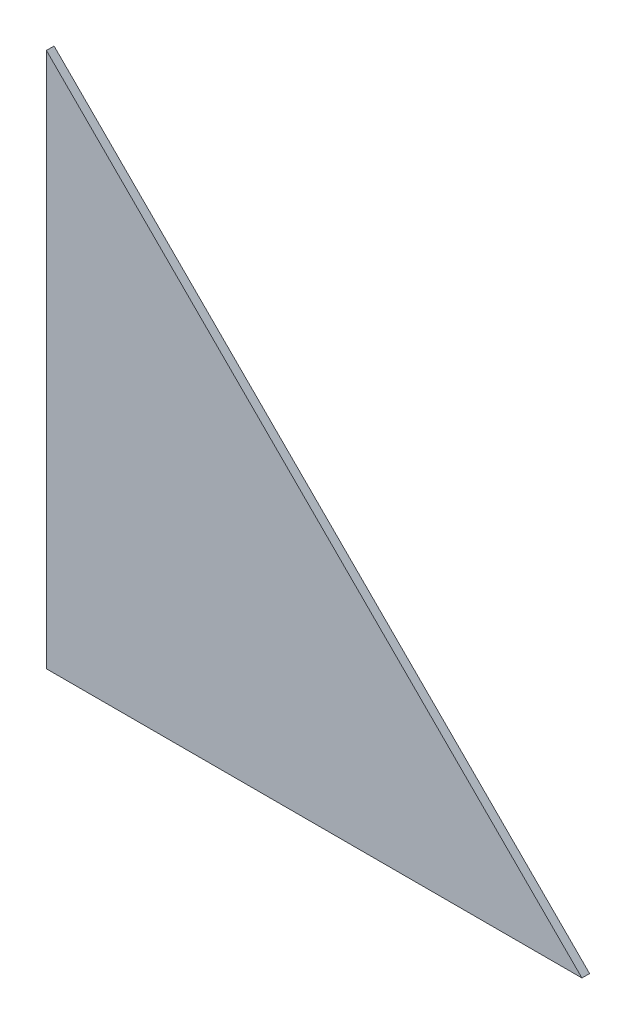
ISO-10303-21;
HEADER;
FILE_DESCRIPTION(('STEP AP214'),'2;1');
FILE_NAME('part.step','',(''),(''),'','','');
FILE_SCHEMA(('AUTOMOTIVE_DESIGN { 1 0 10303 214 1 1 1 1 }'));
ENDSEC;
DATA;
#1=APPLICATION_CONTEXT('core data for automotive mechanical design processes');
#2=APPLICATION_PROTOCOL_DEFINITION('international standard','automotive_design',2000,#1);
#3=PRODUCT_CONTEXT('',#1,'mechanical');
#4=PRODUCT('Part','Part','',(#3));
#5=PRODUCT_RELATED_PRODUCT_CATEGORY('part','',(#4));
#6=PRODUCT_DEFINITION_FORMATION('','',#4);
#7=PRODUCT_DEFINITION_CONTEXT('part definition',#1,'design');
#8=PRODUCT_DEFINITION('design','',#6,#7);
#9=PRODUCT_DEFINITION_SHAPE('','',#8);
#10=(LENGTH_UNIT() NAMED_UNIT(*) SI_UNIT(.MILLI.,.METRE.));
#11=(NAMED_UNIT(*) PLANE_ANGLE_UNIT() SI_UNIT($,.RADIAN.));
#12=(NAMED_UNIT(*) SI_UNIT($,.STERADIAN.) SOLID_ANGLE_UNIT());
#13=UNCERTAINTY_MEASURE_WITH_UNIT(LENGTH_MEASURE(1.E-05),#10,'distance_accuracy_value','');
#14=(GEOMETRIC_REPRESENTATION_CONTEXT(3) GLOBAL_UNCERTAINTY_ASSIGNED_CONTEXT((#13)) GLOBAL_UNIT_ASSIGNED_CONTEXT((#10,
#11,#12)) REPRESENTATION_CONTEXT('',''));
#15=CARTESIAN_POINT('',(0.,0.,0.));
#16=DIRECTION('',(0.,0.,1.));
#17=DIRECTION('',(1.,0.,0.));
#18=AXIS2_PLACEMENT_3D('',#15,#16,#17);
#19=CARTESIAN_POINT('',(0.,0.,1.));
#20=DIRECTION('',(1.,0.,0.));
#21=DIRECTION('',(0.,0.,-1.));
#22=AXIS2_PLACEMENT_3D('',#19,#20,#21);
#23=PLANE('',#22);
#24=DIRECTION('',(0.,-1.,0.));
#25=VECTOR('',#24,1.);
#26=CARTESIAN_POINT('',(0.,0.,0.));
#27=LINE('',#26,#25);
#28=CARTESIAN_POINT('',(0.,70.,0.));
#29=VERTEX_POINT('',#28);
#30=CARTESIAN_POINT('',(0.,0.,0.));
#31=VERTEX_POINT('',#30);
#32=EDGE_CURVE('E89',#29,#31,#27,.T.);
#33=ORIENTED_EDGE('',*,*,#32,.T.);
#34=DIRECTION('',(0.,0.,-1.));
#35=VECTOR('',#34,1.);
#36=CARTESIAN_POINT('',(0.,0.,1.));
#37=LINE('',#36,#35);
#38=CARTESIAN_POINT('',(0.,0.,1.));
#39=VERTEX_POINT('',#38);
#40=EDGE_CURVE('E11',#39,#31,#37,.T.);
#41=ORIENTED_EDGE('',*,*,#40,.F.);
#42=DIRECTION('',(0.,-1.,0.));
#43=VECTOR('',#42,1.);
#44=CARTESIAN_POINT('',(0.,0.,1.));
#45=LINE('',#44,#43);
#46=CARTESIAN_POINT('',(0.,70.,1.));
#47=VERTEX_POINT('',#46);
#48=EDGE_CURVE('E81',#47,#39,#45,.T.);
#49=ORIENTED_EDGE('',*,*,#48,.F.);
#50=DIRECTION('',(0.,0.,-1.));
#51=VECTOR('',#50,1.);
#52=CARTESIAN_POINT('',(0.,70.,1.));
#53=LINE('',#52,#51);
#54=EDGE_CURVE('E90',#47,#29,#53,.T.);
#55=ORIENTED_EDGE('',*,*,#54,.T.);
#56=EDGE_LOOP('',(#33,#41,#49,#55));
#57=FACE_BOUND('',#56,.T.);
#58=ADVANCED_FACE('F39',(#57),#23,.F.);
#59=CARTESIAN_POINT('',(0.,0.,1.));
#60=DIRECTION('',(0.,1.,0.));
#61=DIRECTION('',(0.,0.,1.));
#62=AXIS2_PLACEMENT_3D('',#59,#60,#61);
#63=PLANE('',#62);
#64=DIRECTION('',(1.,0.,0.));
#65=VECTOR('',#64,1.);
#66=CARTESIAN_POINT('',(0.,0.,0.));
#67=LINE('',#66,#65);
#68=CARTESIAN_POINT('',(70.,0.,0.));
#69=VERTEX_POINT('',#68);
#70=EDGE_CURVE('E68',#31,#69,#67,.T.);
#71=ORIENTED_EDGE('',*,*,#70,.T.);
#72=DIRECTION('',(0.,0.,-1.));
#73=VECTOR('',#72,1.);
#74=CARTESIAN_POINT('',(70.,0.,1.));
#75=LINE('',#74,#73);
#76=CARTESIAN_POINT('',(70.,0.,1.));
#77=VERTEX_POINT('',#76);
#78=EDGE_CURVE('E48',#77,#69,#75,.T.);
#79=ORIENTED_EDGE('',*,*,#78,.F.);
#80=DIRECTION('',(1.,0.,0.));
#81=VECTOR('',#80,1.);
#82=CARTESIAN_POINT('',(0.,0.,1.));
#83=LINE('',#82,#81);
#84=EDGE_CURVE('E76',#39,#77,#83,.T.);
#85=ORIENTED_EDGE('',*,*,#84,.F.);
#86=ORIENTED_EDGE('',*,*,#40,.T.);
#87=EDGE_LOOP('',(#71,#79,#85,#86));
#88=FACE_BOUND('',#87,.T.);
#89=ADVANCED_FACE('F77',(#88),#63,.F.);
#90=CARTESIAN_POINT('',(0.,70.,1.));
#91=DIRECTION('',(-0.707106781186547,-0.707106781186547,0.));
#92=DIRECTION('',(0.707106781186548,-0.707106781186548,0.));
#93=AXIS2_PLACEMENT_3D('',#90,#91,#92);
#94=PLANE('',#93);
#95=DIRECTION('',(-0.707106781186548,0.707106781186548,0.));
#96=VECTOR('',#95,1.);
#97=CARTESIAN_POINT('',(0.,70.,0.));
#98=LINE('',#97,#96);
#99=EDGE_CURVE('E73',#69,#29,#98,.T.);
#100=ORIENTED_EDGE('',*,*,#99,.T.);
#101=ORIENTED_EDGE('',*,*,#54,.F.);
#102=DIRECTION('',(-0.707106781186548,0.707106781186548,0.));
#103=VECTOR('',#102,1.);
#104=CARTESIAN_POINT('',(0.,70.,1.));
#105=LINE('',#104,#103);
#106=EDGE_CURVE('E56',#77,#47,#105,.T.);
#107=ORIENTED_EDGE('',*,*,#106,.F.);
#108=ORIENTED_EDGE('',*,*,#78,.T.);
#109=EDGE_LOOP('',(#100,#101,#107,#108));
#110=FACE_BOUND('',#109,.T.);
#111=ADVANCED_FACE('F102',(#110),#94,.F.);
#112=CARTESIAN_POINT('',(0.,0.,1.));
#113=DIRECTION('',(0.,0.,-1.));
#114=DIRECTION('',(-1.,0.,0.));
#115=AXIS2_PLACEMENT_3D('',#112,#113,#114);
#116=PLANE('',#115);
#117=ORIENTED_EDGE('',*,*,#48,.T.);
#118=ORIENTED_EDGE('',*,*,#84,.T.);
#119=ORIENTED_EDGE('',*,*,#106,.T.);
#120=EDGE_LOOP('',(#117,#118,#119));
#121=FACE_BOUND('',#120,.T.);
#122=ADVANCED_FACE('F84',(#121),#116,.F.);
#123=CARTESIAN_POINT('',(0.,0.,0.));
#124=DIRECTION('',(0.,0.,-1.));
#125=DIRECTION('',(-1.,0.,0.));
#126=AXIS2_PLACEMENT_3D('',#123,#124,#125);
#127=PLANE('',#126);
#128=ORIENTED_EDGE('',*,*,#32,.F.);
#129=ORIENTED_EDGE('',*,*,#99,.F.);
#130=ORIENTED_EDGE('',*,*,#70,.F.);
#131=EDGE_LOOP('',(#128,#129,#130));
#132=FACE_BOUND('',#131,.T.);
#133=ADVANCED_FACE('F103',(#132),#127,.T.);
#134=CLOSED_SHELL('',(#58,#89,#111,#122,#133));
#135=MANIFOLD_SOLID_BREP('B2',#134);
#136=ADVANCED_BREP_SHAPE_REPRESENTATION('',(#18,#135),#14);
#137=SHAPE_DEFINITION_REPRESENTATION(#9,#136);
ENDSEC;
END-ISO-10303-21;
